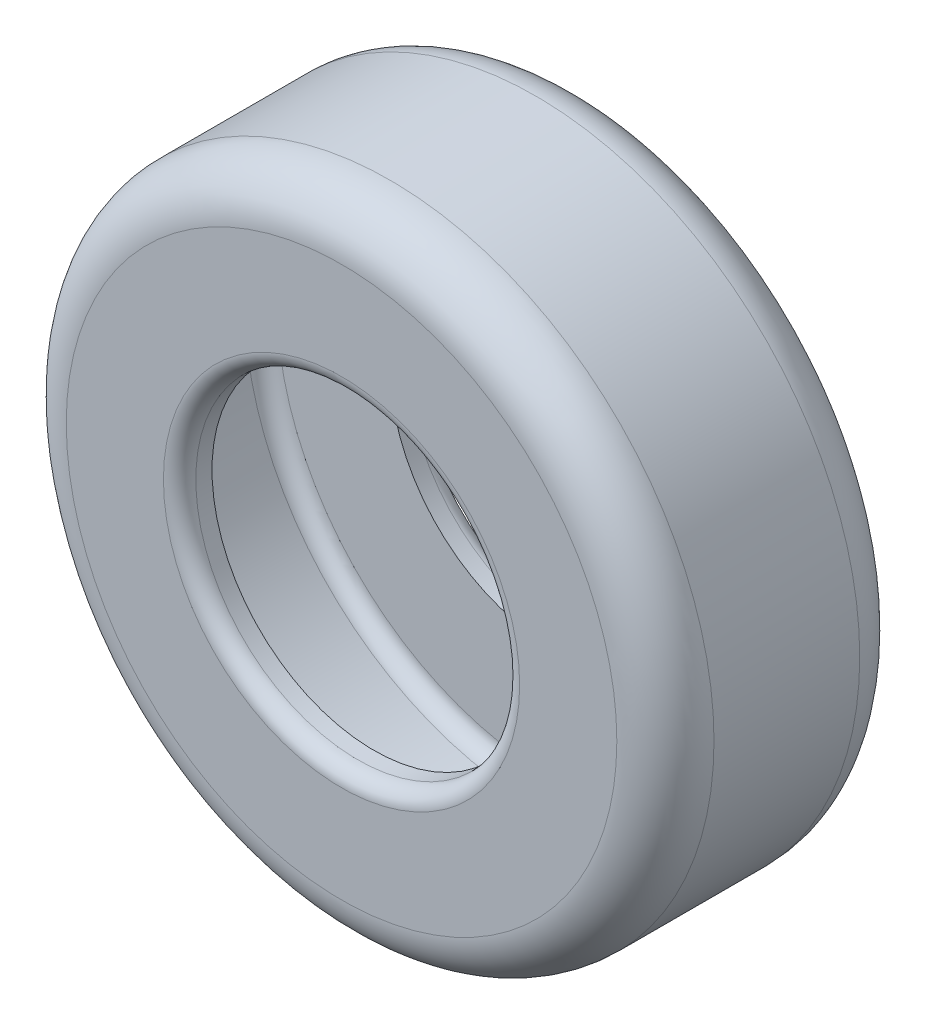
ISO-10303-21;
HEADER;
FILE_DESCRIPTION(('STEP AP214'),'2;1');
FILE_NAME('part.step','',(''),(''),'','','');
FILE_SCHEMA(('AUTOMOTIVE_DESIGN { 1 0 10303 214 1 1 1 1 }'));
ENDSEC;
DATA;
#1=APPLICATION_CONTEXT('core data for automotive mechanical design processes');
#2=APPLICATION_PROTOCOL_DEFINITION('international standard','automotive_design',2000,#1);
#3=PRODUCT_CONTEXT('',#1,'mechanical');
#4=PRODUCT('Part','Part','',(#3));
#5=PRODUCT_RELATED_PRODUCT_CATEGORY('part','',(#4));
#6=PRODUCT_DEFINITION_FORMATION('','',#4);
#7=PRODUCT_DEFINITION_CONTEXT('part definition',#1,'design');
#8=PRODUCT_DEFINITION('design','',#6,#7);
#9=PRODUCT_DEFINITION_SHAPE('','',#8);
#10=(LENGTH_UNIT() NAMED_UNIT(*) SI_UNIT(.MILLI.,.METRE.));
#11=(NAMED_UNIT(*) PLANE_ANGLE_UNIT() SI_UNIT($,.RADIAN.));
#12=(NAMED_UNIT(*) SI_UNIT($,.STERADIAN.) SOLID_ANGLE_UNIT());
#13=UNCERTAINTY_MEASURE_WITH_UNIT(LENGTH_MEASURE(1.E-05),#10,'distance_accuracy_value','');
#14=(GEOMETRIC_REPRESENTATION_CONTEXT(3) GLOBAL_UNCERTAINTY_ASSIGNED_CONTEXT((#13)) GLOBAL_UNIT_ASSIGNED_CONTEXT((#10,
#11,#12)) REPRESENTATION_CONTEXT('',''));
#15=CARTESIAN_POINT('',(0.,0.,0.));
#16=DIRECTION('',(0.,0.,1.));
#17=DIRECTION('',(1.,0.,0.));
#18=AXIS2_PLACEMENT_3D('',#15,#16,#17);
#19=CARTESIAN_POINT('',(0.,0.,15.));
#20=DIRECTION('',(0.,0.,-1.));
#21=DIRECTION('',(-1.,0.,0.));
#22=AXIS2_PLACEMENT_3D('',#19,#20,#21);
#23=CYLINDRICAL_SURFACE('',#22,10.);
#24=CARTESIAN_POINT('',(0.,0.,14.));
#25=DIRECTION('',(0.,0.,1.));
#26=DIRECTION('',(1.,0.,0.));
#27=AXIS2_PLACEMENT_3D('',#24,#25,#26);
#28=CIRCLE('',#27,10.);
#29=CARTESIAN_POINT('',(10.,0.,14.));
#30=VERTEX_POINT('',#29);
#31=EDGE_CURVE('E50',#30,#30,#28,.T.);
#32=ORIENTED_EDGE('',*,*,#31,.T.);
#33=EDGE_LOOP('',(#32));
#34=FACE_BOUND('',#33,.T.);
#35=CARTESIAN_POINT('',(0.,0.,13.));
#36=DIRECTION('',(0.,0.,1.));
#37=DIRECTION('',(1.,0.,0.));
#38=AXIS2_PLACEMENT_3D('',#35,#36,#37);
#39=CIRCLE('',#38,10.);
#40=CARTESIAN_POINT('',(10.,0.,13.));
#41=VERTEX_POINT('',#40);
#42=EDGE_CURVE('E74',#41,#41,#39,.F.);
#43=ORIENTED_EDGE('',*,*,#42,.T.);
#44=EDGE_LOOP('',(#43));
#45=FACE_BOUND('',#44,.T.);
#46=ADVANCED_FACE('F39',(#34,#45),#23,.F.);
#47=CARTESIAN_POINT('',(0.,0.,15.));
#48=DIRECTION('',(0.,0.,1.));
#49=DIRECTION('',(1.,0.,0.));
#50=AXIS2_PLACEMENT_3D('',#47,#48,#49);
#51=PLANE('',#50);
#52=CARTESIAN_POINT('',(0.,0.,15.));
#53=DIRECTION('',(0.,0.,1.));
#54=DIRECTION('',(1.,0.,0.));
#55=AXIS2_PLACEMENT_3D('',#52,#53,#54);
#56=CIRCLE('',#55,11.);
#57=CARTESIAN_POINT('',(11.,0.,15.));
#58=VERTEX_POINT('',#57);
#59=EDGE_CURVE('E11',#58,#58,#56,.F.);
#60=ORIENTED_EDGE('',*,*,#59,.T.);
#61=EDGE_LOOP('',(#60));
#62=FACE_BOUND('',#61,.T.);
#63=CARTESIAN_POINT('',(0.,0.,15.));
#64=DIRECTION('',(0.,0.,1.));
#65=DIRECTION('',(1.,0.,0.));
#66=AXIS2_PLACEMENT_3D('',#63,#64,#65);
#67=CIRCLE('',#66,17.);
#68=CARTESIAN_POINT('',(17.,0.,15.));
#69=VERTEX_POINT('',#68);
#70=EDGE_CURVE('E59',#69,#69,#67,.T.);
#71=ORIENTED_EDGE('',*,*,#70,.T.);
#72=EDGE_LOOP('',(#71));
#73=FACE_BOUND('',#72,.T.);
#74=ADVANCED_FACE('F100',(#62,#73),#51,.T.);
#75=CARTESIAN_POINT('',(0.,0.,0.));
#76=DIRECTION('',(0.,0.,1.));
#77=DIRECTION('',(1.,0.,0.));
#78=AXIS2_PLACEMENT_3D('',#75,#76,#77);
#79=PLANE('',#78);
#80=CARTESIAN_POINT('',(0.,0.,0.));
#81=DIRECTION('',(0.,0.,1.));
#82=DIRECTION('',(1.,0.,0.));
#83=AXIS2_PLACEMENT_3D('',#80,#81,#82);
#84=CIRCLE('',#83,11.);
#85=CARTESIAN_POINT('',(11.,0.,0.));
#86=VERTEX_POINT('',#85);
#87=EDGE_CURVE('E54',#86,#86,#84,.T.);
#88=ORIENTED_EDGE('',*,*,#87,.T.);
#89=EDGE_LOOP('',(#88));
#90=FACE_BOUND('',#89,.T.);
#91=CARTESIAN_POINT('',(0.,0.,0.));
#92=DIRECTION('',(0.,0.,1.));
#93=DIRECTION('',(1.,0.,0.));
#94=AXIS2_PLACEMENT_3D('',#91,#92,#93);
#95=CIRCLE('',#94,17.);
#96=CARTESIAN_POINT('',(17.,0.,0.));
#97=VERTEX_POINT('',#96);
#98=EDGE_CURVE('E62',#97,#97,#95,.F.);
#99=ORIENTED_EDGE('',*,*,#98,.T.);
#100=EDGE_LOOP('',(#99));
#101=FACE_BOUND('',#100,.T.);
#102=ADVANCED_FACE('F107',(#90,#101),#79,.F.);
#103=CARTESIAN_POINT('',(0.,0.,15.));
#104=DIRECTION('',(0.,0.,-1.));
#105=DIRECTION('',(-1.,0.,0.));
#106=AXIS2_PLACEMENT_3D('',#103,#104,#105);
#107=CYLINDRICAL_SURFACE('',#106,20.);
#108=CARTESIAN_POINT('',(0.,0.,3.));
#109=DIRECTION('',(0.,0.,1.));
#110=DIRECTION('',(1.,0.,0.));
#111=AXIS2_PLACEMENT_3D('',#108,#109,#110);
#112=CIRCLE('',#111,20.);
#113=CARTESIAN_POINT('',(20.,0.,3.));
#114=VERTEX_POINT('',#113);
#115=EDGE_CURVE('E65',#114,#114,#112,.T.);
#116=ORIENTED_EDGE('',*,*,#115,.T.);
#117=EDGE_LOOP('',(#116));
#118=FACE_BOUND('',#117,.T.);
#119=CARTESIAN_POINT('',(0.,0.,12.));
#120=DIRECTION('',(0.,0.,1.));
#121=DIRECTION('',(1.,0.,0.));
#122=AXIS2_PLACEMENT_3D('',#119,#120,#121);
#123=CIRCLE('',#122,20.);
#124=CARTESIAN_POINT('',(20.,0.,12.));
#125=VERTEX_POINT('',#124);
#126=EDGE_CURVE('E68',#125,#125,#123,.F.);
#127=ORIENTED_EDGE('',*,*,#126,.T.);
#128=EDGE_LOOP('',(#127));
#129=FACE_BOUND('',#128,.T.);
#130=ADVANCED_FACE('F112',(#118,#129),#107,.T.);
#131=CARTESIAN_POINT('',(0.,0.,2.));
#132=DIRECTION('',(0.,0.,1.));
#133=DIRECTION('',(1.,0.,0.));
#134=AXIS2_PLACEMENT_3D('',#131,#132,#133);
#135=CIRCLE('',#134,10.);
#136=CARTESIAN_POINT('',(10.,0.,2.));
#137=VERTEX_POINT('',#136);
#138=EDGE_CURVE('E71',#137,#137,#135,.F.);
#139=ORIENTED_EDGE('',*,*,#138,.F.);
#140=EDGE_LOOP('',(#139));
#141=FACE_BOUND('',#140,.T.);
#142=CARTESIAN_POINT('',(0.,0.,1.));
#143=DIRECTION('',(0.,0.,1.));
#144=DIRECTION('',(1.,0.,0.));
#145=AXIS2_PLACEMENT_3D('',#142,#143,#144);
#146=CIRCLE('',#145,10.);
#147=CARTESIAN_POINT('',(10.,0.,1.));
#148=VERTEX_POINT('',#147);
#149=EDGE_CURVE('E46',#148,#148,#146,.F.);
#150=ORIENTED_EDGE('',*,*,#149,.T.);
#151=EDGE_LOOP('',(#150));
#152=FACE_BOUND('',#151,.T.);
#153=ADVANCED_FACE('F103',(#141,#152),#23,.F.);
#154=CARTESIAN_POINT('',(0.,0.,3.));
#155=DIRECTION('',(0.,0.,1.));
#156=DIRECTION('',(1.,0.,0.));
#157=AXIS2_PLACEMENT_3D('',#154,#155,#156);
#158=TOROIDAL_SURFACE('',#157,17.,3.);
#159=ORIENTED_EDGE('',*,*,#98,.F.);
#160=EDGE_LOOP('',(#159));
#161=FACE_BOUND('',#160,.T.);
#162=ORIENTED_EDGE('',*,*,#115,.F.);
#163=EDGE_LOOP('',(#162));
#164=FACE_BOUND('',#163,.T.);
#165=ADVANCED_FACE('F111',(#161,#164),#158,.T.);
#166=CARTESIAN_POINT('',(0.,0.,12.));
#167=DIRECTION('',(0.,0.,1.));
#168=DIRECTION('',(1.,0.,0.));
#169=AXIS2_PLACEMENT_3D('',#166,#167,#168);
#170=TOROIDAL_SURFACE('',#169,17.,3.);
#171=ORIENTED_EDGE('',*,*,#126,.F.);
#172=EDGE_LOOP('',(#171));
#173=FACE_BOUND('',#172,.T.);
#174=ORIENTED_EDGE('',*,*,#70,.F.);
#175=EDGE_LOOP('',(#174));
#176=FACE_BOUND('',#175,.T.);
#177=ADVANCED_FACE('F118',(#173,#176),#170,.T.);
#178=CARTESIAN_POINT('',(0.,0.,1.));
#179=DIRECTION('',(0.,0.,1.));
#180=DIRECTION('',(1.,0.,0.));
#181=AXIS2_PLACEMENT_3D('',#178,#179,#180);
#182=TOROIDAL_SURFACE('',#181,11.,1.);
#183=ORIENTED_EDGE('',*,*,#149,.F.);
#184=EDGE_LOOP('',(#183));
#185=FACE_BOUND('',#184,.T.);
#186=ORIENTED_EDGE('',*,*,#87,.F.);
#187=EDGE_LOOP('',(#186));
#188=FACE_BOUND('',#187,.T.);
#189=ADVANCED_FACE('F182',(#185,#188),#182,.T.);
#190=CARTESIAN_POINT('',(0.,0.,14.));
#191=DIRECTION('',(0.,0.,1.));
#192=DIRECTION('',(1.,0.,0.));
#193=AXIS2_PLACEMENT_3D('',#190,#191,#192);
#194=TOROIDAL_SURFACE('',#193,11.,1.);
#195=ORIENTED_EDGE('',*,*,#59,.F.);
#196=EDGE_LOOP('',(#195));
#197=FACE_BOUND('',#196,.T.);
#198=ORIENTED_EDGE('',*,*,#31,.F.);
#199=EDGE_LOOP('',(#198));
#200=FACE_BOUND('',#199,.T.);
#201=ADVANCED_FACE('F41',(#197,#200),#194,.T.);
#202=CARTESIAN_POINT('',(0.,0.,13.));
#203=DIRECTION('',(0.,0.,1.));
#204=DIRECTION('',(1.,0.,0.));
#205=AXIS2_PLACEMENT_3D('',#202,#203,#204);
#206=PLANE('',#205);
#207=CARTESIAN_POINT('',(0.,0.,13.));
#208=DIRECTION('',(0.,0.,1.));
#209=DIRECTION('',(1.,0.,0.));
#210=AXIS2_PLACEMENT_3D('',#207,#208,#209);
#211=CIRCLE('',#210,17.);
#212=CARTESIAN_POINT('',(17.,0.,13.));
#213=VERTEX_POINT('',#212);
#214=EDGE_CURVE('E77',#213,#213,#211,.T.);
#215=ORIENTED_EDGE('',*,*,#214,.F.);
#216=EDGE_LOOP('',(#215));
#217=FACE_BOUND('',#216,.T.);
#218=ORIENTED_EDGE('',*,*,#42,.F.);
#219=EDGE_LOOP('',(#218));
#220=FACE_BOUND('',#219,.T.);
#221=ADVANCED_FACE('F92',(#217,#220),#206,.F.);
#222=CARTESIAN_POINT('',(0.,0.,2.));
#223=DIRECTION('',(0.,0.,1.));
#224=DIRECTION('',(1.,0.,0.));
#225=AXIS2_PLACEMENT_3D('',#222,#223,#224);
#226=PLANE('',#225);
#227=CARTESIAN_POINT('',(0.,0.,2.));
#228=DIRECTION('',(0.,0.,1.));
#229=DIRECTION('',(1.,0.,0.));
#230=AXIS2_PLACEMENT_3D('',#227,#228,#229);
#231=CIRCLE('',#230,17.);
#232=CARTESIAN_POINT('',(17.,0.,2.));
#233=VERTEX_POINT('',#232);
#234=EDGE_CURVE('E78',#233,#233,#231,.F.);
#235=ORIENTED_EDGE('',*,*,#234,.F.);
#236=EDGE_LOOP('',(#235));
#237=FACE_BOUND('',#236,.T.);
#238=ORIENTED_EDGE('',*,*,#138,.T.);
#239=EDGE_LOOP('',(#238));
#240=FACE_BOUND('',#239,.T.);
#241=ADVANCED_FACE('F95',(#237,#240),#226,.T.);
#242=CARTESIAN_POINT('',(0.,0.,15.));
#243=DIRECTION('',(0.,0.,-1.));
#244=DIRECTION('',(-1.,0.,0.));
#245=AXIS2_PLACEMENT_3D('',#242,#243,#244);
#246=CYLINDRICAL_SURFACE('',#245,18.);
#247=CARTESIAN_POINT('',(0.,0.,3.));
#248=DIRECTION('',(0.,0.,-1.));
#249=DIRECTION('',(-1.,0.,0.));
#250=AXIS2_PLACEMENT_3D('',#247,#248,#249);
#251=CIRCLE('',#250,18.);
#252=CARTESIAN_POINT('',(-18.,0.,3.));
#253=VERTEX_POINT('',#252);
#254=EDGE_CURVE('E81',#253,#253,#251,.F.);
#255=ORIENTED_EDGE('',*,*,#254,.F.);
#256=EDGE_LOOP('',(#255));
#257=FACE_BOUND('',#256,.T.);
#258=CARTESIAN_POINT('',(0.,0.,12.));
#259=DIRECTION('',(0.,0.,-1.));
#260=DIRECTION('',(-1.,0.,0.));
#261=AXIS2_PLACEMENT_3D('',#258,#259,#260);
#262=CIRCLE('',#261,18.);
#263=CARTESIAN_POINT('',(-18.,0.,12.));
#264=VERTEX_POINT('',#263);
#265=EDGE_CURVE('E84',#264,#264,#262,.T.);
#266=ORIENTED_EDGE('',*,*,#265,.F.);
#267=EDGE_LOOP('',(#266));
#268=FACE_BOUND('',#267,.T.);
#269=ADVANCED_FACE('F126',(#257,#268),#246,.F.);
#270=CARTESIAN_POINT('',(0.,0.,3.));
#271=DIRECTION('',(0.,0.,1.));
#272=DIRECTION('',(1.,0.,0.));
#273=AXIS2_PLACEMENT_3D('',#270,#271,#272);
#274=TOROIDAL_SURFACE('',#273,17.,1.);
#275=ORIENTED_EDGE('',*,*,#234,.T.);
#276=EDGE_LOOP('',(#275));
#277=FACE_BOUND('',#276,.T.);
#278=ORIENTED_EDGE('',*,*,#254,.T.);
#279=EDGE_LOOP('',(#278));
#280=FACE_BOUND('',#279,.T.);
#281=ADVANCED_FACE('F132',(#277,#280),#274,.F.);
#282=CARTESIAN_POINT('',(0.,0.,12.));
#283=DIRECTION('',(0.,0.,1.));
#284=DIRECTION('',(1.,0.,0.));
#285=AXIS2_PLACEMENT_3D('',#282,#283,#284);
#286=TOROIDAL_SURFACE('',#285,17.,1.);
#287=ORIENTED_EDGE('',*,*,#265,.T.);
#288=EDGE_LOOP('',(#287));
#289=FACE_BOUND('',#288,.T.);
#290=ORIENTED_EDGE('',*,*,#214,.T.);
#291=EDGE_LOOP('',(#290));
#292=FACE_BOUND('',#291,.T.);
#293=ADVANCED_FACE('F90',(#289,#292),#286,.F.);
#294=CLOSED_SHELL('',(#46,#74,#102,#130,#153,#165,#177,#189,#201,#221,#241,#269,#281,#293));
#295=MANIFOLD_SOLID_BREP('B2',#294);
#296=ADVANCED_BREP_SHAPE_REPRESENTATION('',(#18,#295),#14);
#297=SHAPE_DEFINITION_REPRESENTATION(#9,#296);
ENDSEC;
END-ISO-10303-21;
